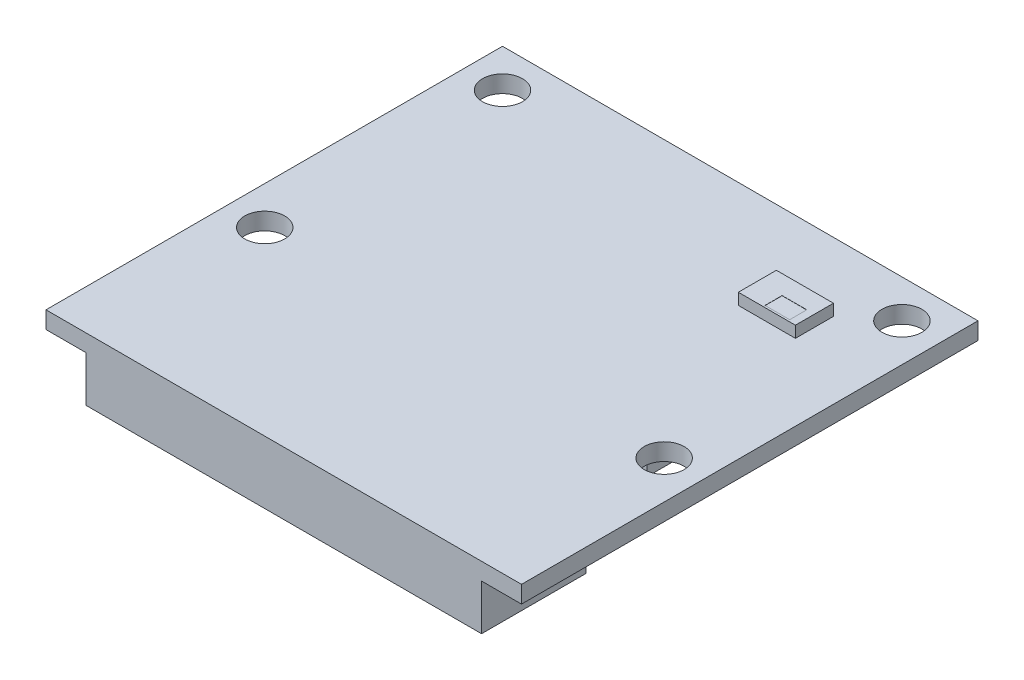
ISO-10303-21;
HEADER;
FILE_DESCRIPTION(('STEP AP214'),'2;1');
FILE_NAME('part.step','',(''),(''),'','','');
FILE_SCHEMA(('AUTOMOTIVE_DESIGN { 1 0 10303 214 1 1 1 1 }'));
ENDSEC;
DATA;
#1=APPLICATION_CONTEXT('core data for automotive mechanical design processes');
#2=APPLICATION_PROTOCOL_DEFINITION('international standard','automotive_design',2000,#1);
#3=PRODUCT_CONTEXT('',#1,'mechanical');
#4=PRODUCT('Part','Part','',(#3));
#5=PRODUCT_RELATED_PRODUCT_CATEGORY('part','',(#4));
#6=PRODUCT_DEFINITION_FORMATION('','',#4);
#7=PRODUCT_DEFINITION_CONTEXT('part definition',#1,'design');
#8=PRODUCT_DEFINITION('design','',#6,#7);
#9=PRODUCT_DEFINITION_SHAPE('','',#8);
#10=(LENGTH_UNIT() NAMED_UNIT(*) SI_UNIT(.MILLI.,.METRE.));
#11=(NAMED_UNIT(*) PLANE_ANGLE_UNIT() SI_UNIT($,.RADIAN.));
#12=(NAMED_UNIT(*) SI_UNIT($,.STERADIAN.) SOLID_ANGLE_UNIT());
#13=UNCERTAINTY_MEASURE_WITH_UNIT(LENGTH_MEASURE(1.E-05),#10,'distance_accuracy_value','');
#14=(GEOMETRIC_REPRESENTATION_CONTEXT(3) GLOBAL_UNCERTAINTY_ASSIGNED_CONTEXT((#13)) GLOBAL_UNIT_ASSIGNED_CONTEXT((#10,
#11,#12)) REPRESENTATION_CONTEXT('',''));
#15=CARTESIAN_POINT('',(0.,0.,0.));
#16=DIRECTION('',(0.,0.,1.));
#17=DIRECTION('',(1.,0.,0.));
#18=AXIS2_PLACEMENT_3D('',#15,#16,#17);
#19=CARTESIAN_POINT('',(0.,0.,0.));
#20=DIRECTION('',(0.,1.,0.));
#21=DIRECTION('',(0.,0.,1.));
#22=AXIS2_PLACEMENT_3D('',#19,#20,#21);
#23=PLANE('',#22);
#24=CARTESIAN_POINT('',(-10.5,0.,-12.5));
#25=DIRECTION('',(0.,1.,0.));
#26=DIRECTION('',(0.,0.,-1.));
#27=AXIS2_PLACEMENT_3D('',#24,#25,#26);
#28=CIRCLE('',#27,1.05);
#29=CARTESIAN_POINT('',(-10.5,0.,-13.55));
#30=VERTEX_POINT('',#29);
#31=EDGE_CURVE('E374',#30,#30,#28,.T.);
#32=ORIENTED_EDGE('',*,*,#31,.F.);
#33=EDGE_LOOP('',(#32));
#34=FACE_BOUND('',#33,.T.);
#35=CARTESIAN_POINT('',(-10.5,0.,0.));
#36=DIRECTION('',(0.,1.,0.));
#37=DIRECTION('',(0.,0.,-1.));
#38=AXIS2_PLACEMENT_3D('',#35,#36,#37);
#39=CIRCLE('',#38,1.05);
#40=CARTESIAN_POINT('',(-10.5,0.,-1.05));
#41=VERTEX_POINT('',#40);
#42=EDGE_CURVE('E380',#41,#41,#39,.T.);
#43=ORIENTED_EDGE('',*,*,#42,.F.);
#44=EDGE_LOOP('',(#43));
#45=FACE_BOUND('',#44,.T.);
#46=CARTESIAN_POINT('',(10.5,0.,0.));
#47=DIRECTION('',(0.,1.,0.));
#48=DIRECTION('',(0.,0.,1.));
#49=AXIS2_PLACEMENT_3D('',#46,#47,#48);
#50=CIRCLE('',#49,1.05);
#51=CARTESIAN_POINT('',(10.5,0.,1.05));
#52=VERTEX_POINT('',#51);
#53=EDGE_CURVE('E385',#52,#52,#50,.T.);
#54=ORIENTED_EDGE('',*,*,#53,.F.);
#55=EDGE_LOOP('',(#54));
#56=FACE_BOUND('',#55,.T.);
#57=CARTESIAN_POINT('',(10.5,0.,-12.5));
#58=DIRECTION('',(0.,1.,0.));
#59=DIRECTION('',(0.,0.,1.));
#60=AXIS2_PLACEMENT_3D('',#57,#58,#59);
#61=CIRCLE('',#60,1.05);
#62=CARTESIAN_POINT('',(10.5,0.,-11.45));
#63=VERTEX_POINT('',#62);
#64=EDGE_CURVE('E391',#63,#63,#61,.T.);
#65=ORIENTED_EDGE('',*,*,#64,.F.);
#66=EDGE_LOOP('',(#65));
#67=FACE_BOUND('',#66,.T.);
#68=DIRECTION('',(0.,0.,1.));
#69=VECTOR('',#68,1.);
#70=CARTESIAN_POINT('',(-12.5,0.,-14.5));
#71=LINE('',#70,#69);
#72=CARTESIAN_POINT('',(-12.5,0.,-14.5));
#73=VERTEX_POINT('',#72);
#74=CARTESIAN_POINT('',(-12.5,0.,9.5));
#75=VERTEX_POINT('',#74);
#76=EDGE_CURVE('E328',#73,#75,#71,.T.);
#77=ORIENTED_EDGE('',*,*,#76,.T.);
#78=DIRECTION('',(1.,0.,0.));
#79=VECTOR('',#78,1.);
#80=CARTESIAN_POINT('',(-12.5,0.,9.5));
#81=LINE('',#80,#79);
#82=CARTESIAN_POINT('',(12.5,0.,9.5));
#83=VERTEX_POINT('',#82);
#84=EDGE_CURVE('E331',#75,#83,#81,.T.);
#85=ORIENTED_EDGE('',*,*,#84,.T.);
#86=DIRECTION('',(0.,0.,-1.));
#87=VECTOR('',#86,1.);
#88=CARTESIAN_POINT('',(12.5,0.,-14.5));
#89=LINE('',#88,#87);
#90=CARTESIAN_POINT('',(12.5,0.,-14.5));
#91=VERTEX_POINT('',#90);
#92=EDGE_CURVE('E335',#83,#91,#89,.T.);
#93=ORIENTED_EDGE('',*,*,#92,.T.);
#94=DIRECTION('',(-1.,0.,0.));
#95=VECTOR('',#94,1.);
#96=CARTESIAN_POINT('',(-12.5,0.,-14.5));
#97=LINE('',#96,#95);
#98=EDGE_CURVE('E338',#91,#73,#97,.T.);
#99=ORIENTED_EDGE('',*,*,#98,.T.);
#100=EDGE_LOOP('',(#77,#85,#93,#99));
#101=FACE_BOUND('',#100,.T.);
#102=DIRECTION('',(1.,0.,0.));
#103=VECTOR('',#102,1.);
#104=CARTESIAN_POINT('',(5.5,0.,-8.90000000000001));
#105=LINE('',#104,#103);
#106=CARTESIAN_POINT('',(5.5,0.,-8.90000000000001));
#107=VERTEX_POINT('',#106);
#108=CARTESIAN_POINT('',(8.5,0.,-8.90000000000001));
#109=VERTEX_POINT('',#108);
#110=EDGE_CURVE('E224',#107,#109,#105,.T.);
#111=ORIENTED_EDGE('',*,*,#110,.F.);
#112=DIRECTION('',(0.,0.,1.));
#113=VECTOR('',#112,1.);
#114=CARTESIAN_POINT('',(5.5,0.,-10.9));
#115=LINE('',#114,#113);
#116=CARTESIAN_POINT('',(5.5,0.,-10.9));
#117=VERTEX_POINT('',#116);
#118=EDGE_CURVE('E207',#117,#107,#115,.T.);
#119=ORIENTED_EDGE('',*,*,#118,.F.);
#120=DIRECTION('',(-1.,0.,0.));
#121=VECTOR('',#120,1.);
#122=CARTESIAN_POINT('',(5.5,0.,-10.9));
#123=LINE('',#122,#121);
#124=CARTESIAN_POINT('',(8.5,0.,-10.9));
#125=VERTEX_POINT('',#124);
#126=EDGE_CURVE('E215',#125,#117,#123,.T.);
#127=ORIENTED_EDGE('',*,*,#126,.F.);
#128=DIRECTION('',(0.,0.,-1.));
#129=VECTOR('',#128,1.);
#130=CARTESIAN_POINT('',(8.5,0.,-10.9));
#131=LINE('',#130,#129);
#132=EDGE_CURVE('E226',#109,#125,#131,.T.);
#133=ORIENTED_EDGE('',*,*,#132,.F.);
#134=EDGE_LOOP('',(#111,#119,#127,#133));
#135=FACE_BOUND('',#134,.T.);
#136=ADVANCED_FACE('F33',(#34,#45,#56,#67,#101,#135),#23,.T.);
#137=CARTESIAN_POINT('',(0.,-0.9,0.));
#138=DIRECTION('',(0.,1.,0.));
#139=DIRECTION('',(0.,0.,1.));
#140=AXIS2_PLACEMENT_3D('',#137,#138,#139);
#141=PLANE('',#140);
#142=DIRECTION('',(0.,0.,-1.));
#143=VECTOR('',#142,1.);
#144=CARTESIAN_POINT('',(-10.4,-0.9,9.5));
#145=LINE('',#144,#143);
#146=CARTESIAN_POINT('',(-10.4,-0.9,9.5));
#147=VERTEX_POINT('',#146);
#148=CARTESIAN_POINT('',(-10.4,-0.9,4.));
#149=VERTEX_POINT('',#148);
#150=EDGE_CURVE('E270',#147,#149,#145,.T.);
#151=ORIENTED_EDGE('',*,*,#150,.F.);
#152=DIRECTION('',(1.,0.,0.));
#153=VECTOR('',#152,1.);
#154=CARTESIAN_POINT('',(-12.5,-0.9,9.5));
#155=LINE('',#154,#153);
#156=CARTESIAN_POINT('',(-12.5,-0.9,9.5));
#157=VERTEX_POINT('',#156);
#158=EDGE_CURVE('E313',#157,#147,#155,.T.);
#159=ORIENTED_EDGE('',*,*,#158,.F.);
#160=DIRECTION('',(0.,0.,1.));
#161=VECTOR('',#160,1.);
#162=CARTESIAN_POINT('',(-12.5,-0.9,-14.5));
#163=LINE('',#162,#161);
#164=CARTESIAN_POINT('',(-12.5,-0.9,-14.5));
#165=VERTEX_POINT('',#164);
#166=EDGE_CURVE('E314',#165,#157,#163,.T.);
#167=ORIENTED_EDGE('',*,*,#166,.F.);
#168=DIRECTION('',(-1.,0.,0.));
#169=VECTOR('',#168,1.);
#170=CARTESIAN_POINT('',(-12.5,-0.9,-14.5));
#171=LINE('',#170,#169);
#172=CARTESIAN_POINT('',(12.5,-0.9,-14.5));
#173=VERTEX_POINT('',#172);
#174=EDGE_CURVE('E324',#173,#165,#171,.T.);
#175=ORIENTED_EDGE('',*,*,#174,.F.);
#176=DIRECTION('',(0.,0.,-1.));
#177=VECTOR('',#176,1.);
#178=CARTESIAN_POINT('',(12.5,-0.9,-14.5));
#179=LINE('',#178,#177);
#180=CARTESIAN_POINT('',(12.5,-0.9,9.5));
#181=VERTEX_POINT('',#180);
#182=EDGE_CURVE('E320',#181,#173,#179,.T.);
#183=ORIENTED_EDGE('',*,*,#182,.F.);
#184=CARTESIAN_POINT('',(10.4,-0.9,9.5));
#185=VERTEX_POINT('',#184);
#186=EDGE_CURVE('E310',#185,#181,#155,.T.);
#187=ORIENTED_EDGE('',*,*,#186,.F.);
#188=DIRECTION('',(0.,0.,1.));
#189=VECTOR('',#188,1.);
#190=CARTESIAN_POINT('',(10.4,-0.9,9.5));
#191=LINE('',#190,#189);
#192=CARTESIAN_POINT('',(10.4,-0.9,4.));
#193=VERTEX_POINT('',#192);
#194=EDGE_CURVE('E275',#193,#185,#191,.T.);
#195=ORIENTED_EDGE('',*,*,#194,.F.);
#196=DIRECTION('',(1.,0.,0.));
#197=VECTOR('',#196,1.);
#198=CARTESIAN_POINT('',(-10.4,-0.9,4.));
#199=LINE('',#198,#197);
#200=EDGE_CURVE('E282',#149,#193,#199,.T.);
#201=ORIENTED_EDGE('',*,*,#200,.F.);
#202=EDGE_LOOP('',(#151,#159,#167,#175,#183,#187,#195,#201));
#203=FACE_BOUND('',#202,.T.);
#204=CARTESIAN_POINT('',(-10.5,-0.9,-12.5));
#205=DIRECTION('',(0.,1.,0.));
#206=DIRECTION('',(0.,0.,-1.));
#207=AXIS2_PLACEMENT_3D('',#204,#205,#206);
#208=CIRCLE('',#207,1.05);
#209=CARTESIAN_POINT('',(-10.5,-0.9,-13.55));
#210=VERTEX_POINT('',#209);
#211=EDGE_CURVE('E376',#210,#210,#208,.T.);
#212=ORIENTED_EDGE('',*,*,#211,.T.);
#213=EDGE_LOOP('',(#212));
#214=FACE_BOUND('',#213,.T.);
#215=CARTESIAN_POINT('',(-10.5,-0.9,0.));
#216=DIRECTION('',(0.,1.,0.));
#217=DIRECTION('',(0.,0.,-1.));
#218=AXIS2_PLACEMENT_3D('',#215,#216,#217);
#219=CIRCLE('',#218,1.05);
#220=CARTESIAN_POINT('',(-10.5,-0.9,-1.05));
#221=VERTEX_POINT('',#220);
#222=EDGE_CURVE('E382',#221,#221,#219,.T.);
#223=ORIENTED_EDGE('',*,*,#222,.T.);
#224=EDGE_LOOP('',(#223));
#225=FACE_BOUND('',#224,.T.);
#226=CARTESIAN_POINT('',(10.5,-0.9,0.));
#227=DIRECTION('',(0.,1.,0.));
#228=DIRECTION('',(0.,0.,1.));
#229=AXIS2_PLACEMENT_3D('',#226,#227,#228);
#230=CIRCLE('',#229,1.05);
#231=CARTESIAN_POINT('',(10.5,-0.9,1.05));
#232=VERTEX_POINT('',#231);
#233=EDGE_CURVE('E388',#232,#232,#230,.T.);
#234=ORIENTED_EDGE('',*,*,#233,.T.);
#235=EDGE_LOOP('',(#234));
#236=FACE_BOUND('',#235,.T.);
#237=CARTESIAN_POINT('',(10.5,-0.9,-12.5));
#238=DIRECTION('',(0.,1.,0.));
#239=DIRECTION('',(0.,0.,1.));
#240=AXIS2_PLACEMENT_3D('',#237,#238,#239);
#241=CIRCLE('',#240,1.05);
#242=CARTESIAN_POINT('',(10.5,-0.9,-11.45));
#243=VERTEX_POINT('',#242);
#244=EDGE_CURVE('E332',#243,#243,#241,.T.);
#245=ORIENTED_EDGE('',*,*,#244,.T.);
#246=EDGE_LOOP('',(#245));
#247=FACE_BOUND('',#246,.T.);
#248=DIRECTION('',(0.,0.,-1.));
#249=VECTOR('',#248,1.);
#250=CARTESIAN_POINT('',(-9.,-0.9,-0.900000000000005));
#251=LINE('',#250,#249);
#252=CARTESIAN_POINT('',(-9.,-0.9,-0.900000000000005));
#253=VERTEX_POINT('',#252);
#254=CARTESIAN_POINT('',(-9.,-0.9,-12.5));
#255=VERTEX_POINT('',#254);
#256=EDGE_CURVE('E237',#253,#255,#251,.T.);
#257=ORIENTED_EDGE('',*,*,#256,.F.);
#258=DIRECTION('',(-1.,0.,0.));
#259=VECTOR('',#258,1.);
#260=CARTESIAN_POINT('',(-9.,-0.9,-0.900000000000005));
#261=LINE('',#260,#259);
#262=CARTESIAN_POINT('',(8.7,-0.9,-0.900000000000005));
#263=VERTEX_POINT('',#262);
#264=EDGE_CURVE('E242',#263,#253,#261,.T.);
#265=ORIENTED_EDGE('',*,*,#264,.F.);
#266=DIRECTION('',(0.,0.,1.));
#267=VECTOR('',#266,1.);
#268=CARTESIAN_POINT('',(8.7,-0.9,-0.900000000000005));
#269=LINE('',#268,#267);
#270=CARTESIAN_POINT('',(8.7,-0.9,-12.5));
#271=VERTEX_POINT('',#270);
#272=EDGE_CURVE('E254',#271,#263,#269,.T.);
#273=ORIENTED_EDGE('',*,*,#272,.F.);
#274=DIRECTION('',(1.,0.,0.));
#275=VECTOR('',#274,1.);
#276=CARTESIAN_POINT('',(-9.,-0.9,-12.5));
#277=LINE('',#276,#275);
#278=EDGE_CURVE('E251',#255,#271,#277,.T.);
#279=ORIENTED_EDGE('',*,*,#278,.F.);
#280=EDGE_LOOP('',(#257,#265,#273,#279));
#281=FACE_BOUND('',#280,.T.);
#282=ADVANCED_FACE('F360',(#203,#214,#225,#236,#247,#281),#141,.F.);
#283=CARTESIAN_POINT('',(-12.5,-0.9,-14.5));
#284=DIRECTION('',(-1.,0.,0.));
#285=DIRECTION('',(0.,0.,1.));
#286=AXIS2_PLACEMENT_3D('',#283,#284,#285);
#287=PLANE('',#286);
#288=ORIENTED_EDGE('',*,*,#76,.F.);
#289=DIRECTION('',(0.,1.,0.));
#290=VECTOR('',#289,1.);
#291=CARTESIAN_POINT('',(-12.5,-0.9,-14.5));
#292=LINE('',#291,#290);
#293=EDGE_CURVE('E11',#165,#73,#292,.T.);
#294=ORIENTED_EDGE('',*,*,#293,.F.);
#295=ORIENTED_EDGE('',*,*,#166,.T.);
#296=DIRECTION('',(0.,1.,0.));
#297=VECTOR('',#296,1.);
#298=CARTESIAN_POINT('',(-12.5,-0.9,9.5));
#299=LINE('',#298,#297);
#300=EDGE_CURVE('E327',#157,#75,#299,.T.);
#301=ORIENTED_EDGE('',*,*,#300,.T.);
#302=EDGE_LOOP('',(#288,#294,#295,#301));
#303=FACE_BOUND('',#302,.T.);
#304=ADVANCED_FACE('F35',(#303),#287,.T.);
#305=CARTESIAN_POINT('',(-12.5,-0.9,-14.5));
#306=DIRECTION('',(0.,0.,-1.));
#307=DIRECTION('',(-1.,0.,0.));
#308=AXIS2_PLACEMENT_3D('',#305,#306,#307);
#309=PLANE('',#308);
#310=ORIENTED_EDGE('',*,*,#98,.F.);
#311=DIRECTION('',(0.,1.,0.));
#312=VECTOR('',#311,1.);
#313=CARTESIAN_POINT('',(12.5,-0.9,-14.5));
#314=LINE('',#313,#312);
#315=EDGE_CURVE('E42',#173,#91,#314,.T.);
#316=ORIENTED_EDGE('',*,*,#315,.F.);
#317=ORIENTED_EDGE('',*,*,#174,.T.);
#318=ORIENTED_EDGE('',*,*,#293,.T.);
#319=EDGE_LOOP('',(#310,#316,#317,#318));
#320=FACE_BOUND('',#319,.T.);
#321=ADVANCED_FACE('F357',(#320),#309,.T.);
#322=CARTESIAN_POINT('',(12.5,-0.9,-14.5));
#323=DIRECTION('',(1.,0.,0.));
#324=DIRECTION('',(0.,0.,-1.));
#325=AXIS2_PLACEMENT_3D('',#322,#323,#324);
#326=PLANE('',#325);
#327=ORIENTED_EDGE('',*,*,#92,.F.);
#328=DIRECTION('',(0.,1.,0.));
#329=VECTOR('',#328,1.);
#330=CARTESIAN_POINT('',(12.5,-0.9,9.5));
#331=LINE('',#330,#329);
#332=EDGE_CURVE('E342',#181,#83,#331,.T.);
#333=ORIENTED_EDGE('',*,*,#332,.F.);
#334=ORIENTED_EDGE('',*,*,#182,.T.);
#335=ORIENTED_EDGE('',*,*,#315,.T.);
#336=EDGE_LOOP('',(#327,#333,#334,#335));
#337=FACE_BOUND('',#336,.T.);
#338=ADVANCED_FACE('F415',(#337),#326,.T.);
#339=CARTESIAN_POINT('',(-12.5,-0.9,9.5));
#340=DIRECTION('',(0.,0.,1.));
#341=DIRECTION('',(1.,0.,0.));
#342=AXIS2_PLACEMENT_3D('',#339,#340,#341);
#343=PLANE('',#342);
#344=ORIENTED_EDGE('',*,*,#84,.F.);
#345=ORIENTED_EDGE('',*,*,#300,.F.);
#346=ORIENTED_EDGE('',*,*,#158,.T.);
#347=DIRECTION('',(0.,1.,0.));
#348=VECTOR('',#347,1.);
#349=CARTESIAN_POINT('',(-10.4,-3.3,9.5));
#350=LINE('',#349,#348);
#351=CARTESIAN_POINT('',(-10.4,-3.3,9.5));
#352=VERTEX_POINT('',#351);
#353=EDGE_CURVE('E281',#352,#147,#350,.T.);
#354=ORIENTED_EDGE('',*,*,#353,.F.);
#355=DIRECTION('',(-1.,0.,0.));
#356=VECTOR('',#355,1.);
#357=CARTESIAN_POINT('',(-10.4,-3.3,9.5));
#358=LINE('',#357,#356);
#359=CARTESIAN_POINT('',(10.4,-3.3,9.5));
#360=VERTEX_POINT('',#359);
#361=EDGE_CURVE('E279',#360,#352,#358,.T.);
#362=ORIENTED_EDGE('',*,*,#361,.F.);
#363=DIRECTION('',(0.,1.,0.));
#364=VECTOR('',#363,1.);
#365=CARTESIAN_POINT('',(10.4,-3.3,9.5));
#366=LINE('',#365,#364);
#367=EDGE_CURVE('E294',#360,#185,#366,.T.);
#368=ORIENTED_EDGE('',*,*,#367,.T.);
#369=ORIENTED_EDGE('',*,*,#186,.T.);
#370=ORIENTED_EDGE('',*,*,#332,.T.);
#371=EDGE_LOOP('',(#344,#345,#346,#354,#362,#368,#369,#370));
#372=FACE_BOUND('',#371,.T.);
#373=ADVANCED_FACE('F350',(#372),#343,.T.);
#374=CARTESIAN_POINT('',(10.5,-0.9,-12.5));
#375=DIRECTION('',(0.,1.,0.));
#376=DIRECTION('',(0.,0.,1.));
#377=AXIS2_PLACEMENT_3D('',#374,#375,#376);
#378=CYLINDRICAL_SURFACE('',#377,1.05);
#379=ORIENTED_EDGE('',*,*,#244,.F.);
#380=EDGE_LOOP('',(#379));
#381=FACE_BOUND('',#380,.T.);
#382=ORIENTED_EDGE('',*,*,#64,.T.);
#383=EDGE_LOOP('',(#382));
#384=FACE_BOUND('',#383,.T.);
#385=ADVANCED_FACE('F398',(#381,#384),#378,.F.);
#386=CARTESIAN_POINT('',(10.5,-0.9,0.));
#387=DIRECTION('',(0.,1.,0.));
#388=DIRECTION('',(0.,0.,1.));
#389=AXIS2_PLACEMENT_3D('',#386,#387,#388);
#390=CYLINDRICAL_SURFACE('',#389,1.05);
#391=ORIENTED_EDGE('',*,*,#233,.F.);
#392=EDGE_LOOP('',(#391));
#393=FACE_BOUND('',#392,.T.);
#394=ORIENTED_EDGE('',*,*,#53,.T.);
#395=EDGE_LOOP('',(#394));
#396=FACE_BOUND('',#395,.T.);
#397=ADVANCED_FACE('F424',(#393,#396),#390,.F.);
#398=CARTESIAN_POINT('',(-10.5,-0.9,0.));
#399=DIRECTION('',(0.,1.,0.));
#400=DIRECTION('',(0.,0.,1.));
#401=AXIS2_PLACEMENT_3D('',#398,#399,#400);
#402=CYLINDRICAL_SURFACE('',#401,1.05);
#403=ORIENTED_EDGE('',*,*,#222,.F.);
#404=EDGE_LOOP('',(#403));
#405=FACE_BOUND('',#404,.T.);
#406=ORIENTED_EDGE('',*,*,#42,.T.);
#407=EDGE_LOOP('',(#406));
#408=FACE_BOUND('',#407,.T.);
#409=ADVANCED_FACE('F429',(#405,#408),#402,.F.);
#410=CARTESIAN_POINT('',(-10.5,-0.9,-12.5));
#411=DIRECTION('',(0.,1.,0.));
#412=DIRECTION('',(0.,0.,1.));
#413=AXIS2_PLACEMENT_3D('',#410,#411,#412);
#414=CYLINDRICAL_SURFACE('',#413,1.05);
#415=ORIENTED_EDGE('',*,*,#211,.F.);
#416=EDGE_LOOP('',(#415));
#417=FACE_BOUND('',#416,.T.);
#418=ORIENTED_EDGE('',*,*,#31,.T.);
#419=EDGE_LOOP('',(#418));
#420=FACE_BOUND('',#419,.T.);
#421=ADVANCED_FACE('F436',(#417,#420),#414,.F.);
#422=CARTESIAN_POINT('',(-10.4,-3.3,9.5));
#423=DIRECTION('',(1.,0.,0.));
#424=DIRECTION('',(0.,0.,-1.));
#425=AXIS2_PLACEMENT_3D('',#422,#423,#424);
#426=PLANE('',#425);
#427=ORIENTED_EDGE('',*,*,#150,.T.);
#428=DIRECTION('',(0.,1.,0.));
#429=VECTOR('',#428,1.);
#430=CARTESIAN_POINT('',(-10.4,-3.3,4.));
#431=LINE('',#430,#429);
#432=CARTESIAN_POINT('',(-10.4,-3.3,4.));
#433=VERTEX_POINT('',#432);
#434=EDGE_CURVE('E300',#433,#149,#431,.T.);
#435=ORIENTED_EDGE('',*,*,#434,.F.);
#436=DIRECTION('',(0.,0.,-1.));
#437=VECTOR('',#436,1.);
#438=CARTESIAN_POINT('',(-10.4,-3.3,9.5));
#439=LINE('',#438,#437);
#440=EDGE_CURVE('E271',#352,#433,#439,.T.);
#441=ORIENTED_EDGE('',*,*,#440,.F.);
#442=ORIENTED_EDGE('',*,*,#353,.T.);
#443=EDGE_LOOP('',(#427,#435,#441,#442));
#444=FACE_BOUND('',#443,.T.);
#445=ADVANCED_FACE('F364',(#444),#426,.F.);
#446=CARTESIAN_POINT('',(-10.4,-3.3,4.));
#447=DIRECTION('',(0.,0.,1.));
#448=DIRECTION('',(1.,0.,0.));
#449=AXIS2_PLACEMENT_3D('',#446,#447,#448);
#450=PLANE('',#449);
#451=ORIENTED_EDGE('',*,*,#200,.T.);
#452=DIRECTION('',(0.,1.,0.));
#453=VECTOR('',#452,1.);
#454=CARTESIAN_POINT('',(10.4,-3.3,4.));
#455=LINE('',#454,#453);
#456=CARTESIAN_POINT('',(10.4,-3.3,4.));
#457=VERTEX_POINT('',#456);
#458=EDGE_CURVE('E287',#457,#193,#455,.T.);
#459=ORIENTED_EDGE('',*,*,#458,.F.);
#460=DIRECTION('',(1.,0.,0.));
#461=VECTOR('',#460,1.);
#462=CARTESIAN_POINT('',(-10.4,-3.3,4.));
#463=LINE('',#462,#461);
#464=EDGE_CURVE('E274',#433,#457,#463,.T.);
#465=ORIENTED_EDGE('',*,*,#464,.F.);
#466=ORIENTED_EDGE('',*,*,#434,.T.);
#467=EDGE_LOOP('',(#451,#459,#465,#466));
#468=FACE_BOUND('',#467,.T.);
#469=ADVANCED_FACE('F373',(#468),#450,.F.);
#470=CARTESIAN_POINT('',(10.4,-3.3,9.5));
#471=DIRECTION('',(-1.,0.,0.));
#472=DIRECTION('',(0.,0.,1.));
#473=AXIS2_PLACEMENT_3D('',#470,#471,#472);
#474=PLANE('',#473);
#475=ORIENTED_EDGE('',*,*,#194,.T.);
#476=ORIENTED_EDGE('',*,*,#367,.F.);
#477=DIRECTION('',(0.,0.,1.));
#478=VECTOR('',#477,1.);
#479=CARTESIAN_POINT('',(10.4,-3.3,9.5));
#480=LINE('',#479,#478);
#481=EDGE_CURVE('E277',#457,#360,#480,.T.);
#482=ORIENTED_EDGE('',*,*,#481,.F.);
#483=ORIENTED_EDGE('',*,*,#458,.T.);
#484=EDGE_LOOP('',(#475,#476,#482,#483));
#485=FACE_BOUND('',#484,.T.);
#486=ADVANCED_FACE('F371',(#485),#474,.F.);
#487=CARTESIAN_POINT('',(0.,-3.3,0.));
#488=DIRECTION('',(0.,-1.,0.));
#489=DIRECTION('',(0.,0.,-1.));
#490=AXIS2_PLACEMENT_3D('',#487,#488,#489);
#491=PLANE('',#490);
#492=ORIENTED_EDGE('',*,*,#440,.T.);
#493=ORIENTED_EDGE('',*,*,#464,.T.);
#494=ORIENTED_EDGE('',*,*,#481,.T.);
#495=ORIENTED_EDGE('',*,*,#361,.T.);
#496=EDGE_LOOP('',(#492,#493,#494,#495));
#497=FACE_BOUND('',#496,.T.);
#498=ADVANCED_FACE('F367',(#497),#491,.T.);
#499=CARTESIAN_POINT('',(-9.,-2.2,-0.900000000000005));
#500=DIRECTION('',(1.,0.,0.));
#501=DIRECTION('',(0.,0.,-1.));
#502=AXIS2_PLACEMENT_3D('',#499,#500,#501);
#503=PLANE('',#502);
#504=ORIENTED_EDGE('',*,*,#256,.T.);
#505=DIRECTION('',(0.,1.,0.));
#506=VECTOR('',#505,1.);
#507=CARTESIAN_POINT('',(-9.,-2.2,-12.5));
#508=LINE('',#507,#506);
#509=CARTESIAN_POINT('',(-9.,-2.2,-12.5));
#510=VERTEX_POINT('',#509);
#511=EDGE_CURVE('E267',#510,#255,#508,.T.);
#512=ORIENTED_EDGE('',*,*,#511,.F.);
#513=DIRECTION('',(0.,0.,-1.));
#514=VECTOR('',#513,1.);
#515=CARTESIAN_POINT('',(-9.,-2.2,-0.900000000000005));
#516=LINE('',#515,#514);
#517=CARTESIAN_POINT('',(-9.,-2.2,-0.900000000000005));
#518=VERTEX_POINT('',#517);
#519=EDGE_CURVE('E238',#518,#510,#516,.T.);
#520=ORIENTED_EDGE('',*,*,#519,.F.);
#521=DIRECTION('',(0.,1.,0.));
#522=VECTOR('',#521,1.);
#523=CARTESIAN_POINT('',(-9.,-2.2,-0.900000000000005));
#524=LINE('',#523,#522);
#525=EDGE_CURVE('E248',#518,#253,#524,.T.);
#526=ORIENTED_EDGE('',*,*,#525,.T.);
#527=EDGE_LOOP('',(#504,#512,#520,#526));
#528=FACE_BOUND('',#527,.T.);
#529=ADVANCED_FACE('F448',(#528),#503,.F.);
#530=CARTESIAN_POINT('',(-9.,-2.2,-12.5));
#531=DIRECTION('',(0.,0.,1.));
#532=DIRECTION('',(1.,0.,0.));
#533=AXIS2_PLACEMENT_3D('',#530,#531,#532);
#534=PLANE('',#533);
#535=ORIENTED_EDGE('',*,*,#278,.T.);
#536=DIRECTION('',(0.,1.,0.));
#537=VECTOR('',#536,1.);
#538=CARTESIAN_POINT('',(8.7,-2.2,-12.5));
#539=LINE('',#538,#537);
#540=CARTESIAN_POINT('',(8.7,-2.2,-12.5));
#541=VERTEX_POINT('',#540);
#542=EDGE_CURVE('E264',#541,#271,#539,.T.);
#543=ORIENTED_EDGE('',*,*,#542,.F.);
#544=DIRECTION('',(1.,0.,0.));
#545=VECTOR('',#544,1.);
#546=CARTESIAN_POINT('',(-9.,-2.2,-12.5));
#547=LINE('',#546,#545);
#548=EDGE_CURVE('E241',#510,#541,#547,.T.);
#549=ORIENTED_EDGE('',*,*,#548,.F.);
#550=ORIENTED_EDGE('',*,*,#511,.T.);
#551=EDGE_LOOP('',(#535,#543,#549,#550));
#552=FACE_BOUND('',#551,.T.);
#553=ADVANCED_FACE('F451',(#552),#534,.F.);
#554=CARTESIAN_POINT('',(8.7,-2.2,-0.900000000000005));
#555=DIRECTION('',(-1.,0.,0.));
#556=DIRECTION('',(0.,0.,1.));
#557=AXIS2_PLACEMENT_3D('',#554,#555,#556);
#558=PLANE('',#557);
#559=ORIENTED_EDGE('',*,*,#272,.T.);
#560=DIRECTION('',(0.,1.,0.));
#561=VECTOR('',#560,1.);
#562=CARTESIAN_POINT('',(8.7,-2.2,-0.900000000000005));
#563=LINE('',#562,#561);
#564=CARTESIAN_POINT('',(8.7,-2.2,-0.900000000000005));
#565=VERTEX_POINT('',#564);
#566=EDGE_CURVE('E261',#565,#263,#563,.T.);
#567=ORIENTED_EDGE('',*,*,#566,.F.);
#568=DIRECTION('',(0.,0.,1.));
#569=VECTOR('',#568,1.);
#570=CARTESIAN_POINT('',(8.7,-2.2,-0.900000000000005));
#571=LINE('',#570,#569);
#572=EDGE_CURVE('E244',#541,#565,#571,.T.);
#573=ORIENTED_EDGE('',*,*,#572,.F.);
#574=ORIENTED_EDGE('',*,*,#542,.T.);
#575=EDGE_LOOP('',(#559,#567,#573,#574));
#576=FACE_BOUND('',#575,.T.);
#577=ADVANCED_FACE('F455',(#576),#558,.F.);
#578=CARTESIAN_POINT('',(-9.,-2.2,-0.900000000000005));
#579=DIRECTION('',(0.,0.,-1.));
#580=DIRECTION('',(-1.,0.,0.));
#581=AXIS2_PLACEMENT_3D('',#578,#579,#580);
#582=PLANE('',#581);
#583=ORIENTED_EDGE('',*,*,#264,.T.);
#584=ORIENTED_EDGE('',*,*,#525,.F.);
#585=DIRECTION('',(-1.,0.,0.));
#586=VECTOR('',#585,1.);
#587=CARTESIAN_POINT('',(-9.,-2.2,-0.900000000000005));
#588=LINE('',#587,#586);
#589=EDGE_CURVE('E246',#565,#518,#588,.T.);
#590=ORIENTED_EDGE('',*,*,#589,.F.);
#591=ORIENTED_EDGE('',*,*,#566,.T.);
#592=EDGE_LOOP('',(#583,#584,#590,#591));
#593=FACE_BOUND('',#592,.T.);
#594=ADVANCED_FACE('F459',(#593),#582,.F.);
#595=CARTESIAN_POINT('',(0.,-2.2,0.));
#596=DIRECTION('',(0.,-1.,0.));
#597=DIRECTION('',(0.,0.,-1.));
#598=AXIS2_PLACEMENT_3D('',#595,#596,#597);
#599=PLANE('',#598);
#600=ORIENTED_EDGE('',*,*,#519,.T.);
#601=ORIENTED_EDGE('',*,*,#548,.T.);
#602=ORIENTED_EDGE('',*,*,#572,.T.);
#603=ORIENTED_EDGE('',*,*,#589,.T.);
#604=EDGE_LOOP('',(#600,#601,#602,#603));
#605=FACE_BOUND('',#604,.T.);
#606=ADVANCED_FACE('F463',(#605),#599,.T.);
#607=CARTESIAN_POINT('',(5.5,0.6,-10.9));
#608=DIRECTION('',(1.,0.,0.));
#609=DIRECTION('',(0.,0.,-1.));
#610=AXIS2_PLACEMENT_3D('',#607,#608,#609);
#611=PLANE('',#610);
#612=ORIENTED_EDGE('',*,*,#118,.T.);
#613=DIRECTION('',(0.,-1.,0.));
#614=VECTOR('',#613,1.);
#615=CARTESIAN_POINT('',(5.5,0.6,-8.90000000000001));
#616=LINE('',#615,#614);
#617=CARTESIAN_POINT('',(5.5,0.6,-8.90000000000001));
#618=VERTEX_POINT('',#617);
#619=EDGE_CURVE('E235',#618,#107,#616,.T.);
#620=ORIENTED_EDGE('',*,*,#619,.F.);
#621=DIRECTION('',(0.,0.,1.));
#622=VECTOR('',#621,1.);
#623=CARTESIAN_POINT('',(5.5,0.6,-10.9));
#624=LINE('',#623,#622);
#625=CARTESIAN_POINT('',(5.5,0.6,-10.9));
#626=VERTEX_POINT('',#625);
#627=EDGE_CURVE('E211',#626,#618,#624,.T.);
#628=ORIENTED_EDGE('',*,*,#627,.F.);
#629=DIRECTION('',(0.,-1.,0.));
#630=VECTOR('',#629,1.);
#631=CARTESIAN_POINT('',(5.5,0.6,-10.9));
#632=LINE('',#631,#630);
#633=EDGE_CURVE('E221',#626,#117,#632,.T.);
#634=ORIENTED_EDGE('',*,*,#633,.T.);
#635=EDGE_LOOP('',(#612,#620,#628,#634));
#636=FACE_BOUND('',#635,.T.);
#637=ADVANCED_FACE('F467',(#636),#611,.F.);
#638=CARTESIAN_POINT('',(5.5,0.6,-8.90000000000001));
#639=DIRECTION('',(0.,0.,-1.));
#640=DIRECTION('',(-1.,0.,0.));
#641=AXIS2_PLACEMENT_3D('',#638,#639,#640);
#642=PLANE('',#641);
#643=ORIENTED_EDGE('',*,*,#110,.T.);
#644=DIRECTION('',(0.,-1.,0.));
#645=VECTOR('',#644,1.);
#646=CARTESIAN_POINT('',(8.5,0.6,-8.90000000000001));
#647=LINE('',#646,#645);
#648=CARTESIAN_POINT('',(8.5,0.6,-8.90000000000001));
#649=VERTEX_POINT('',#648);
#650=EDGE_CURVE('E232',#649,#109,#647,.T.);
#651=ORIENTED_EDGE('',*,*,#650,.F.);
#652=DIRECTION('',(1.,0.,0.));
#653=VECTOR('',#652,1.);
#654=CARTESIAN_POINT('',(5.5,0.6,-8.90000000000001));
#655=LINE('',#654,#653);
#656=EDGE_CURVE('E214',#618,#649,#655,.T.);
#657=ORIENTED_EDGE('',*,*,#656,.F.);
#658=ORIENTED_EDGE('',*,*,#619,.T.);
#659=EDGE_LOOP('',(#643,#651,#657,#658));
#660=FACE_BOUND('',#659,.T.);
#661=ADVANCED_FACE('F471',(#660),#642,.F.);
#662=CARTESIAN_POINT('',(8.5,0.6,-10.9));
#663=DIRECTION('',(-1.,0.,0.));
#664=DIRECTION('',(0.,0.,1.));
#665=AXIS2_PLACEMENT_3D('',#662,#663,#664);
#666=PLANE('',#665);
#667=ORIENTED_EDGE('',*,*,#132,.T.);
#668=DIRECTION('',(0.,-1.,0.));
#669=VECTOR('',#668,1.);
#670=CARTESIAN_POINT('',(8.5,0.6,-10.9));
#671=LINE('',#670,#669);
#672=CARTESIAN_POINT('',(8.5,0.6,-10.9));
#673=VERTEX_POINT('',#672);
#674=EDGE_CURVE('E58',#673,#125,#671,.T.);
#675=ORIENTED_EDGE('',*,*,#674,.F.);
#676=DIRECTION('',(0.,0.,-1.));
#677=VECTOR('',#676,1.);
#678=CARTESIAN_POINT('',(8.5,0.6,-10.9));
#679=LINE('',#678,#677);
#680=EDGE_CURVE('E217',#649,#673,#679,.T.);
#681=ORIENTED_EDGE('',*,*,#680,.F.);
#682=ORIENTED_EDGE('',*,*,#650,.T.);
#683=EDGE_LOOP('',(#667,#675,#681,#682));
#684=FACE_BOUND('',#683,.T.);
#685=ADVANCED_FACE('F475',(#684),#666,.F.);
#686=CARTESIAN_POINT('',(5.5,0.6,-10.9));
#687=DIRECTION('',(0.,0.,1.));
#688=DIRECTION('',(1.,0.,0.));
#689=AXIS2_PLACEMENT_3D('',#686,#687,#688);
#690=PLANE('',#689);
#691=ORIENTED_EDGE('',*,*,#126,.T.);
#692=ORIENTED_EDGE('',*,*,#633,.F.);
#693=DIRECTION('',(-1.,0.,0.));
#694=VECTOR('',#693,1.);
#695=CARTESIAN_POINT('',(5.5,0.6,-10.9));
#696=LINE('',#695,#694);
#697=EDGE_CURVE('E219',#673,#626,#696,.T.);
#698=ORIENTED_EDGE('',*,*,#697,.F.);
#699=ORIENTED_EDGE('',*,*,#674,.T.);
#700=EDGE_LOOP('',(#691,#692,#698,#699));
#701=FACE_BOUND('',#700,.T.);
#702=ADVANCED_FACE('F479',(#701),#690,.F.);
#703=CARTESIAN_POINT('',(0.,0.6,0.));
#704=DIRECTION('',(0.,1.,0.));
#705=DIRECTION('',(0.,0.,1.));
#706=AXIS2_PLACEMENT_3D('',#703,#704,#705);
#707=PLANE('',#706);
#708=DIRECTION('',(0.,0.,-1.));
#709=VECTOR('',#708,1.);
#710=CARTESIAN_POINT('',(8.1,0.6,-9.00000000000001));
#711=LINE('',#710,#709);
#712=CARTESIAN_POINT('',(8.1,0.6,-9.00000000000001));
#713=VERTEX_POINT('',#712);
#714=CARTESIAN_POINT('',(8.1,0.6,-9.9));
#715=VERTEX_POINT('',#714);
#716=EDGE_CURVE('E50',#713,#715,#711,.T.);
#717=ORIENTED_EDGE('',*,*,#716,.F.);
#718=DIRECTION('',(1.,0.,0.));
#719=VECTOR('',#718,1.);
#720=CARTESIAN_POINT('',(8.1,0.6,-9.00000000000001));
#721=LINE('',#720,#719);
#722=CARTESIAN_POINT('',(6.8,0.6,-9.00000000000001));
#723=VERTEX_POINT('',#722);
#724=EDGE_CURVE('E192',#723,#713,#721,.T.);
#725=ORIENTED_EDGE('',*,*,#724,.F.);
#726=DIRECTION('',(0.,0.,1.));
#727=VECTOR('',#726,1.);
#728=CARTESIAN_POINT('',(6.8,0.6,-9.00000000000001));
#729=LINE('',#728,#727);
#730=CARTESIAN_POINT('',(6.8,0.6,-9.9));
#731=VERTEX_POINT('',#730);
#732=EDGE_CURVE('E195',#731,#723,#729,.T.);
#733=ORIENTED_EDGE('',*,*,#732,.F.);
#734=DIRECTION('',(-1.,0.,0.));
#735=VECTOR('',#734,1.);
#736=CARTESIAN_POINT('',(8.1,0.6,-9.9));
#737=LINE('',#736,#735);
#738=EDGE_CURVE('E201',#715,#731,#737,.T.);
#739=ORIENTED_EDGE('',*,*,#738,.F.);
#740=EDGE_LOOP('',(#717,#725,#733,#739));
#741=FACE_BOUND('',#740,.T.);
#742=ORIENTED_EDGE('',*,*,#627,.T.);
#743=ORIENTED_EDGE('',*,*,#656,.T.);
#744=ORIENTED_EDGE('',*,*,#680,.T.);
#745=ORIENTED_EDGE('',*,*,#697,.T.);
#746=EDGE_LOOP('',(#742,#743,#744,#745));
#747=FACE_BOUND('',#746,.T.);
#748=ADVANCED_FACE('F483',(#741,#747),#707,.T.);
#749=CARTESIAN_POINT('',(8.1,0.59,-9.00000000000001));
#750=DIRECTION('',(1.,0.,0.));
#751=DIRECTION('',(0.,0.,-1.));
#752=AXIS2_PLACEMENT_3D('',#749,#750,#751);
#753=PLANE('',#752);
#754=ORIENTED_EDGE('',*,*,#716,.T.);
#755=DIRECTION('',(0.,1.,0.));
#756=VECTOR('',#755,1.);
#757=CARTESIAN_POINT('',(8.1,0.59,-9.9));
#758=LINE('',#757,#756);
#759=CARTESIAN_POINT('',(8.1,0.59,-9.9));
#760=VERTEX_POINT('',#759);
#761=EDGE_CURVE('E170',#760,#715,#758,.T.);
#762=ORIENTED_EDGE('',*,*,#761,.F.);
#763=DIRECTION('',(0.,0.,-1.));
#764=VECTOR('',#763,1.);
#765=CARTESIAN_POINT('',(8.1,0.59,-9.00000000000001));
#766=LINE('',#765,#764);
#767=CARTESIAN_POINT('',(8.1,0.59,-9.00000000000001));
#768=VERTEX_POINT('',#767);
#769=EDGE_CURVE('E174',#768,#760,#766,.T.);
#770=ORIENTED_EDGE('',*,*,#769,.F.);
#771=DIRECTION('',(0.,1.,0.));
#772=VECTOR('',#771,1.);
#773=CARTESIAN_POINT('',(8.1,0.59,-9.00000000000001));
#774=LINE('',#773,#772);
#775=EDGE_CURVE('E205',#768,#713,#774,.T.);
#776=ORIENTED_EDGE('',*,*,#775,.T.);
#777=EDGE_LOOP('',(#754,#762,#770,#776));
#778=FACE_BOUND('',#777,.T.);
#779=ADVANCED_FACE('F172',(#778),#753,.F.);
#780=CARTESIAN_POINT('',(8.1,0.59,-9.00000000000001));
#781=DIRECTION('',(0.,0.,1.));
#782=DIRECTION('',(1.,0.,0.));
#783=AXIS2_PLACEMENT_3D('',#780,#781,#782);
#784=PLANE('',#783);
#785=ORIENTED_EDGE('',*,*,#724,.T.);
#786=ORIENTED_EDGE('',*,*,#775,.F.);
#787=DIRECTION('',(1.,0.,0.));
#788=VECTOR('',#787,1.);
#789=CARTESIAN_POINT('',(8.1,0.59,-9.00000000000001));
#790=LINE('',#789,#788);
#791=CARTESIAN_POINT('',(6.8,0.59,-9.00000000000001));
#792=VERTEX_POINT('',#791);
#793=EDGE_CURVE('E180',#792,#768,#790,.T.);
#794=ORIENTED_EDGE('',*,*,#793,.F.);
#795=DIRECTION('',(0.,1.,0.));
#796=VECTOR('',#795,1.);
#797=CARTESIAN_POINT('',(6.8,0.59,-9.00000000000001));
#798=LINE('',#797,#796);
#799=EDGE_CURVE('E208',#792,#723,#798,.T.);
#800=ORIENTED_EDGE('',*,*,#799,.T.);
#801=EDGE_LOOP('',(#785,#786,#794,#800));
#802=FACE_BOUND('',#801,.T.);
#803=ADVANCED_FACE('F489',(#802),#784,.F.);
#804=CARTESIAN_POINT('',(6.8,0.59,-9.00000000000001));
#805=DIRECTION('',(-1.,0.,0.));
#806=DIRECTION('',(0.,0.,1.));
#807=AXIS2_PLACEMENT_3D('',#804,#805,#806);
#808=PLANE('',#807);
#809=ORIENTED_EDGE('',*,*,#732,.T.);
#810=ORIENTED_EDGE('',*,*,#799,.F.);
#811=DIRECTION('',(0.,0.,1.));
#812=VECTOR('',#811,1.);
#813=CARTESIAN_POINT('',(6.8,0.59,-9.00000000000001));
#814=LINE('',#813,#812);
#815=CARTESIAN_POINT('',(6.8,0.59,-9.9));
#816=VERTEX_POINT('',#815);
#817=EDGE_CURVE('E188',#816,#792,#814,.T.);
#818=ORIENTED_EDGE('',*,*,#817,.F.);
#819=DIRECTION('',(0.,1.,0.));
#820=VECTOR('',#819,1.);
#821=CARTESIAN_POINT('',(6.8,0.59,-9.9));
#822=LINE('',#821,#820);
#823=EDGE_CURVE('E179',#816,#731,#822,.T.);
#824=ORIENTED_EDGE('',*,*,#823,.T.);
#825=EDGE_LOOP('',(#809,#810,#818,#824));
#826=FACE_BOUND('',#825,.T.);
#827=ADVANCED_FACE('F492',(#826),#808,.F.);
#828=CARTESIAN_POINT('',(8.1,0.59,-9.9));
#829=DIRECTION('',(0.,0.,-1.));
#830=DIRECTION('',(-1.,0.,0.));
#831=AXIS2_PLACEMENT_3D('',#828,#829,#830);
#832=PLANE('',#831);
#833=ORIENTED_EDGE('',*,*,#738,.T.);
#834=ORIENTED_EDGE('',*,*,#823,.F.);
#835=DIRECTION('',(-1.,0.,0.));
#836=VECTOR('',#835,1.);
#837=CARTESIAN_POINT('',(8.1,0.59,-9.9));
#838=LINE('',#837,#836);
#839=EDGE_CURVE('E183',#760,#816,#838,.T.);
#840=ORIENTED_EDGE('',*,*,#839,.F.);
#841=ORIENTED_EDGE('',*,*,#761,.T.);
#842=EDGE_LOOP('',(#833,#834,#840,#841));
#843=FACE_BOUND('',#842,.T.);
#844=ADVANCED_FACE('F184',(#843),#832,.F.);
#845=CARTESIAN_POINT('',(0.,0.59,0.));
#846=DIRECTION('',(0.,1.,0.));
#847=DIRECTION('',(0.,0.,1.));
#848=AXIS2_PLACEMENT_3D('',#845,#846,#847);
#849=PLANE('',#848);
#850=ORIENTED_EDGE('',*,*,#769,.T.);
#851=ORIENTED_EDGE('',*,*,#839,.T.);
#852=ORIENTED_EDGE('',*,*,#817,.T.);
#853=ORIENTED_EDGE('',*,*,#793,.T.);
#854=EDGE_LOOP('',(#850,#851,#852,#853));
#855=FACE_BOUND('',#854,.T.);
#856=ADVANCED_FACE('F190',(#855),#849,.T.);
#857=CLOSED_SHELL('',(#136,#282,#304,#321,#338,#373,#385,#397,#409,#421,#445,#469,#486,#498,
#529,#553,#577,#594,#606,#637,#661,#685,#702,#748,#779,#803,#827,#844,#856));
#858=MANIFOLD_SOLID_BREP('B2',#857);
#859=ADVANCED_BREP_SHAPE_REPRESENTATION('',(#18,#858),#14);
#860=SHAPE_DEFINITION_REPRESENTATION(#9,#859);
ENDSEC;
END-ISO-10303-21;
